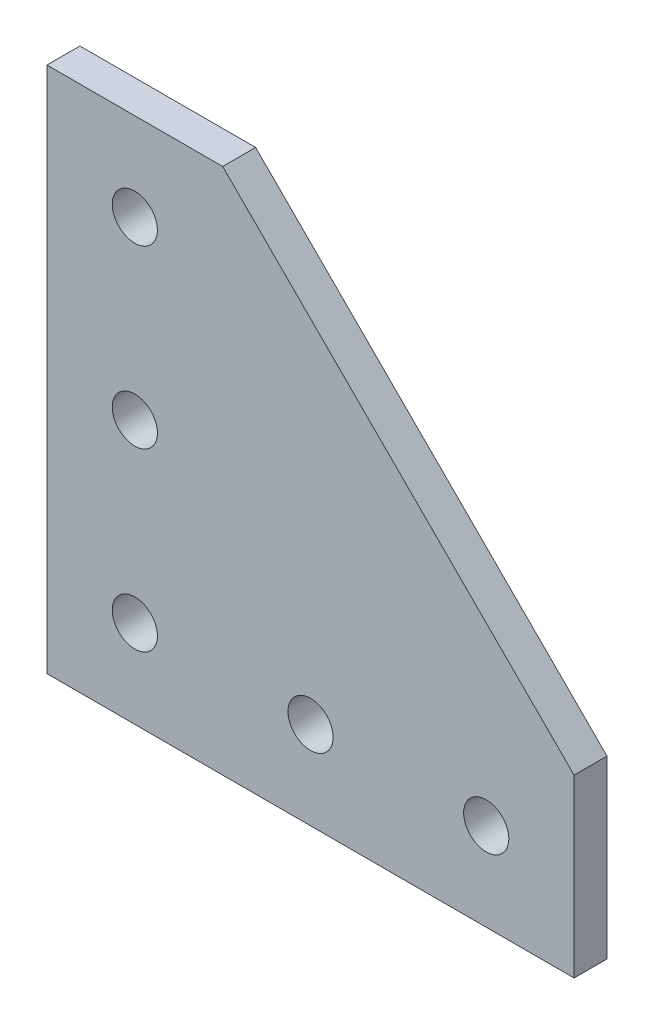
ISO-10303-21;
HEADER;
FILE_DESCRIPTION(('STEP AP214'),'2;1');
FILE_NAME('part.step','',(''),(''),'','','');
FILE_SCHEMA(('AUTOMOTIVE_DESIGN { 1 0 10303 214 1 1 1 1 }'));
ENDSEC;
DATA;
#1=APPLICATION_CONTEXT('core data for automotive mechanical design processes');
#2=APPLICATION_PROTOCOL_DEFINITION('international standard','automotive_design',2000,#1);
#3=PRODUCT_CONTEXT('',#1,'mechanical');
#4=PRODUCT('Part','Part','',(#3));
#5=PRODUCT_RELATED_PRODUCT_CATEGORY('part','',(#4));
#6=PRODUCT_DEFINITION_FORMATION('','',#4);
#7=PRODUCT_DEFINITION_CONTEXT('part definition',#1,'design');
#8=PRODUCT_DEFINITION('design','',#6,#7);
#9=PRODUCT_DEFINITION_SHAPE('','',#8);
#10=(LENGTH_UNIT() NAMED_UNIT(*) SI_UNIT(.MILLI.,.METRE.));
#11=(NAMED_UNIT(*) PLANE_ANGLE_UNIT() SI_UNIT($,.RADIAN.));
#12=(NAMED_UNIT(*) SI_UNIT($,.STERADIAN.) SOLID_ANGLE_UNIT());
#13=UNCERTAINTY_MEASURE_WITH_UNIT(LENGTH_MEASURE(1.E-05),#10,'distance_accuracy_value','');
#14=(GEOMETRIC_REPRESENTATION_CONTEXT(3) GLOBAL_UNCERTAINTY_ASSIGNED_CONTEXT((#13)) GLOBAL_UNIT_ASSIGNED_CONTEXT((#10,
#11,#12)) REPRESENTATION_CONTEXT('',''));
#15=CARTESIAN_POINT('',(0.,0.,0.));
#16=DIRECTION('',(0.,0.,1.));
#17=DIRECTION('',(1.,0.,0.));
#18=AXIS2_PLACEMENT_3D('',#15,#16,#17);
#19=CARTESIAN_POINT('',(0.,0.,2.38125));
#20=DIRECTION('',(0.,0.,-1.));
#21=DIRECTION('',(-1.,0.,0.));
#22=AXIS2_PLACEMENT_3D('',#19,#20,#21);
#23=PLANE('',#22);
#24=CARTESIAN_POINT('',(12.7,63.5,2.38125));
#25=DIRECTION('',(0.,0.,1.));
#26=DIRECTION('',(1.,0.,0.));
#27=AXIS2_PLACEMENT_3D('',#24,#25,#26);
#28=CIRCLE('',#27,3.2639);
#29=CARTESIAN_POINT('',(15.9639,63.5,2.38125));
#30=VERTEX_POINT('',#29);
#31=EDGE_CURVE('E181',#30,#30,#28,.T.);
#32=ORIENTED_EDGE('',*,*,#31,.F.);
#33=EDGE_LOOP('',(#32));
#34=FACE_BOUND('',#33,.T.);
#35=CARTESIAN_POINT('',(38.1,12.7,2.38125));
#36=DIRECTION('',(0.,0.,1.));
#37=DIRECTION('',(1.,0.,0.));
#38=AXIS2_PLACEMENT_3D('',#35,#36,#37);
#39=CIRCLE('',#38,3.26389999999999);
#40=CARTESIAN_POINT('',(41.3639,12.7,2.38125));
#41=VERTEX_POINT('',#40);
#42=EDGE_CURVE('E193',#41,#41,#39,.T.);
#43=ORIENTED_EDGE('',*,*,#42,.F.);
#44=EDGE_LOOP('',(#43));
#45=FACE_BOUND('',#44,.T.);
#46=DIRECTION('',(1.,0.,0.));
#47=VECTOR('',#46,1.);
#48=CARTESIAN_POINT('',(76.2,0.,2.38125));
#49=LINE('',#48,#47);
#50=CARTESIAN_POINT('',(0.,0.,2.38125));
#51=VERTEX_POINT('',#50);
#52=CARTESIAN_POINT('',(76.2,0.,2.38125));
#53=VERTEX_POINT('',#52);
#54=EDGE_CURVE('E121',#51,#53,#49,.T.);
#55=ORIENTED_EDGE('',*,*,#54,.T.);
#56=DIRECTION('',(0.,1.,0.));
#57=VECTOR('',#56,1.);
#58=CARTESIAN_POINT('',(76.2,25.4,2.38125));
#59=LINE('',#58,#57);
#60=CARTESIAN_POINT('',(76.2,25.4,2.38125));
#61=VERTEX_POINT('',#60);
#62=EDGE_CURVE('E88',#53,#61,#59,.T.);
#63=ORIENTED_EDGE('',*,*,#62,.T.);
#64=DIRECTION('',(-0.707106781186547,0.707106781186547,0.));
#65=VECTOR('',#64,1.);
#66=CARTESIAN_POINT('',(76.2,25.4,2.38125));
#67=LINE('',#66,#65);
#68=CARTESIAN_POINT('',(25.4,76.2,2.38125));
#69=VERTEX_POINT('',#68);
#70=EDGE_CURVE('E92',#61,#69,#67,.T.);
#71=ORIENTED_EDGE('',*,*,#70,.T.);
#72=DIRECTION('',(-1.,0.,0.));
#73=VECTOR('',#72,1.);
#74=CARTESIAN_POINT('',(0.,76.2,2.38125));
#75=LINE('',#74,#73);
#76=CARTESIAN_POINT('',(0.,76.2,2.38125));
#77=VERTEX_POINT('',#76);
#78=EDGE_CURVE('E96',#69,#77,#75,.T.);
#79=ORIENTED_EDGE('',*,*,#78,.T.);
#80=DIRECTION('',(0.,-1.,0.));
#81=VECTOR('',#80,1.);
#82=CARTESIAN_POINT('',(0.,0.,2.38125));
#83=LINE('',#82,#81);
#84=EDGE_CURVE('E54',#77,#51,#83,.T.);
#85=ORIENTED_EDGE('',*,*,#84,.T.);
#86=EDGE_LOOP('',(#55,#63,#71,#79,#85));
#87=FACE_BOUND('',#86,.T.);
#88=CARTESIAN_POINT('',(12.7,12.7,2.38125));
#89=DIRECTION('',(0.,0.,1.));
#90=DIRECTION('',(1.,0.,0.));
#91=AXIS2_PLACEMENT_3D('',#88,#89,#90);
#92=CIRCLE('',#91,3.2639);
#93=CARTESIAN_POINT('',(15.9639,12.7,2.38125));
#94=VERTEX_POINT('',#93);
#95=EDGE_CURVE('E116',#94,#94,#92,.T.);
#96=ORIENTED_EDGE('',*,*,#95,.F.);
#97=EDGE_LOOP('',(#96));
#98=FACE_BOUND('',#97,.T.);
#99=CARTESIAN_POINT('',(63.5,12.7,2.38125));
#100=DIRECTION('',(0.,0.,1.));
#101=DIRECTION('',(1.,0.,0.));
#102=AXIS2_PLACEMENT_3D('',#99,#100,#101);
#103=CIRCLE('',#102,3.26389999999999);
#104=CARTESIAN_POINT('',(66.7639,12.7,2.38125));
#105=VERTEX_POINT('',#104);
#106=EDGE_CURVE('E187',#105,#105,#103,.T.);
#107=ORIENTED_EDGE('',*,*,#106,.F.);
#108=EDGE_LOOP('',(#107));
#109=FACE_BOUND('',#108,.T.);
#110=CARTESIAN_POINT('',(12.7,38.1,2.38125));
#111=DIRECTION('',(0.,0.,1.));
#112=DIRECTION('',(1.,0.,0.));
#113=AXIS2_PLACEMENT_3D('',#110,#111,#112);
#114=CIRCLE('',#113,3.26389999999999);
#115=CARTESIAN_POINT('',(15.9639,38.1,2.38125));
#116=VERTEX_POINT('',#115);
#117=EDGE_CURVE('E172',#116,#116,#114,.T.);
#118=ORIENTED_EDGE('',*,*,#117,.F.);
#119=EDGE_LOOP('',(#118));
#120=FACE_BOUND('',#119,.T.);
#121=ADVANCED_FACE('F37',(#34,#45,#87,#98,#109,#120),#23,.F.);
#122=CARTESIAN_POINT('',(0.,0.,-2.38125));
#123=DIRECTION('',(0.,0.,-1.));
#124=DIRECTION('',(-1.,0.,0.));
#125=AXIS2_PLACEMENT_3D('',#122,#123,#124);
#126=PLANE('',#125);
#127=CARTESIAN_POINT('',(12.7,63.5,-2.38125));
#128=DIRECTION('',(0.,0.,1.));
#129=DIRECTION('',(1.,0.,0.));
#130=AXIS2_PLACEMENT_3D('',#127,#128,#129);
#131=CIRCLE('',#130,3.2639);
#132=CARTESIAN_POINT('',(15.9639,63.5,-2.38125));
#133=VERTEX_POINT('',#132);
#134=EDGE_CURVE('E178',#133,#133,#131,.T.);
#135=ORIENTED_EDGE('',*,*,#134,.T.);
#136=EDGE_LOOP('',(#135));
#137=FACE_BOUND('',#136,.T.);
#138=CARTESIAN_POINT('',(38.1,12.7,-2.38125));
#139=DIRECTION('',(0.,0.,1.));
#140=DIRECTION('',(1.,0.,0.));
#141=AXIS2_PLACEMENT_3D('',#138,#139,#140);
#142=CIRCLE('',#141,3.26389999999999);
#143=CARTESIAN_POINT('',(41.3639,12.7,-2.38125));
#144=VERTEX_POINT('',#143);
#145=EDGE_CURVE('E190',#144,#144,#142,.T.);
#146=ORIENTED_EDGE('',*,*,#145,.T.);
#147=EDGE_LOOP('',(#146));
#148=FACE_BOUND('',#147,.T.);
#149=DIRECTION('',(1.,0.,0.));
#150=VECTOR('',#149,1.);
#151=CARTESIAN_POINT('',(76.2,0.,-2.38125));
#152=LINE('',#151,#150);
#153=CARTESIAN_POINT('',(0.,0.,-2.38125));
#154=VERTEX_POINT('',#153);
#155=CARTESIAN_POINT('',(76.2,0.,-2.38125));
#156=VERTEX_POINT('',#155);
#157=EDGE_CURVE('E112',#154,#156,#152,.T.);
#158=ORIENTED_EDGE('',*,*,#157,.F.);
#159=DIRECTION('',(0.,-1.,0.));
#160=VECTOR('',#159,1.);
#161=CARTESIAN_POINT('',(0.,0.,-2.38125));
#162=LINE('',#161,#160);
#163=CARTESIAN_POINT('',(0.,76.2,-2.38125));
#164=VERTEX_POINT('',#163);
#165=EDGE_CURVE('E80',#164,#154,#162,.T.);
#166=ORIENTED_EDGE('',*,*,#165,.F.);
#167=DIRECTION('',(-1.,0.,0.));
#168=VECTOR('',#167,1.);
#169=CARTESIAN_POINT('',(0.,76.2,-2.38125));
#170=LINE('',#169,#168);
#171=CARTESIAN_POINT('',(25.4,76.2,-2.38125));
#172=VERTEX_POINT('',#171);
#173=EDGE_CURVE('E74',#172,#164,#170,.T.);
#174=ORIENTED_EDGE('',*,*,#173,.F.);
#175=DIRECTION('',(-0.707106781186547,0.707106781186547,0.));
#176=VECTOR('',#175,1.);
#177=CARTESIAN_POINT('',(76.2,25.4,-2.38125));
#178=LINE('',#177,#176);
#179=CARTESIAN_POINT('',(76.2,25.4,-2.38125));
#180=VERTEX_POINT('',#179);
#181=EDGE_CURVE('E103',#180,#172,#178,.T.);
#182=ORIENTED_EDGE('',*,*,#181,.F.);
#183=DIRECTION('',(0.,1.,0.));
#184=VECTOR('',#183,1.);
#185=CARTESIAN_POINT('',(76.2,25.4,-2.38125));
#186=LINE('',#185,#184);
#187=EDGE_CURVE('E115',#156,#180,#186,.T.);
#188=ORIENTED_EDGE('',*,*,#187,.F.);
#189=EDGE_LOOP('',(#158,#166,#174,#182,#188));
#190=FACE_BOUND('',#189,.T.);
#191=CARTESIAN_POINT('',(12.7,12.7,-2.38125));
#192=DIRECTION('',(0.,0.,1.));
#193=DIRECTION('',(1.,0.,0.));
#194=AXIS2_PLACEMENT_3D('',#191,#192,#193);
#195=CIRCLE('',#194,3.2639);
#196=CARTESIAN_POINT('',(15.9639,12.7,-2.38125));
#197=VERTEX_POINT('',#196);
#198=EDGE_CURVE('E196',#197,#197,#195,.T.);
#199=ORIENTED_EDGE('',*,*,#198,.T.);
#200=EDGE_LOOP('',(#199));
#201=FACE_BOUND('',#200,.T.);
#202=CARTESIAN_POINT('',(63.5,12.7,-2.38125));
#203=DIRECTION('',(0.,0.,1.));
#204=DIRECTION('',(1.,0.,0.));
#205=AXIS2_PLACEMENT_3D('',#202,#203,#204);
#206=CIRCLE('',#205,3.26389999999999);
#207=CARTESIAN_POINT('',(66.7639,12.7,-2.38125));
#208=VERTEX_POINT('',#207);
#209=EDGE_CURVE('E184',#208,#208,#206,.T.);
#210=ORIENTED_EDGE('',*,*,#209,.T.);
#211=EDGE_LOOP('',(#210));
#212=FACE_BOUND('',#211,.T.);
#213=CARTESIAN_POINT('',(12.7,38.1,-2.38125));
#214=DIRECTION('',(0.,0.,1.));
#215=DIRECTION('',(1.,0.,0.));
#216=AXIS2_PLACEMENT_3D('',#213,#214,#215);
#217=CIRCLE('',#216,3.26389999999999);
#218=CARTESIAN_POINT('',(15.9639,38.1,-2.38125));
#219=VERTEX_POINT('',#218);
#220=EDGE_CURVE('E175',#219,#219,#217,.T.);
#221=ORIENTED_EDGE('',*,*,#220,.T.);
#222=EDGE_LOOP('',(#221));
#223=FACE_BOUND('',#222,.T.);
#224=ADVANCED_FACE('F125',(#137,#148,#190,#201,#212,#223),#126,.T.);
#225=CARTESIAN_POINT('',(76.2,0.,2.38125));
#226=DIRECTION('',(0.,1.,0.));
#227=DIRECTION('',(-1.,0.,0.));
#228=AXIS2_PLACEMENT_3D('',#225,#226,#227);
#229=PLANE('',#228);
#230=ORIENTED_EDGE('',*,*,#157,.T.);
#231=DIRECTION('',(0.,0.,-1.));
#232=VECTOR('',#231,1.);
#233=CARTESIAN_POINT('',(76.2,0.,2.38125));
#234=LINE('',#233,#232);
#235=EDGE_CURVE('E11',#53,#156,#234,.T.);
#236=ORIENTED_EDGE('',*,*,#235,.F.);
#237=ORIENTED_EDGE('',*,*,#54,.F.);
#238=DIRECTION('',(0.,0.,-1.));
#239=VECTOR('',#238,1.);
#240=CARTESIAN_POINT('',(0.,0.,2.38125));
#241=LINE('',#240,#239);
#242=EDGE_CURVE('E108',#51,#154,#241,.T.);
#243=ORIENTED_EDGE('',*,*,#242,.T.);
#244=EDGE_LOOP('',(#230,#236,#237,#243));
#245=FACE_BOUND('',#244,.T.);
#246=ADVANCED_FACE('F39',(#245),#229,.F.);
#247=CARTESIAN_POINT('',(76.2,25.4,2.38125));
#248=DIRECTION('',(-1.,0.,0.));
#249=DIRECTION('',(0.,0.,1.));
#250=AXIS2_PLACEMENT_3D('',#247,#248,#249);
#251=PLANE('',#250);
#252=ORIENTED_EDGE('',*,*,#187,.T.);
#253=DIRECTION('',(0.,0.,-1.));
#254=VECTOR('',#253,1.);
#255=CARTESIAN_POINT('',(76.2,25.4,2.38125));
#256=LINE('',#255,#254);
#257=EDGE_CURVE('E46',#61,#180,#256,.T.);
#258=ORIENTED_EDGE('',*,*,#257,.F.);
#259=ORIENTED_EDGE('',*,*,#62,.F.);
#260=ORIENTED_EDGE('',*,*,#235,.T.);
#261=EDGE_LOOP('',(#252,#258,#259,#260));
#262=FACE_BOUND('',#261,.T.);
#263=ADVANCED_FACE('F253',(#262),#251,.F.);
#264=CARTESIAN_POINT('',(76.2,25.4,2.38125));
#265=DIRECTION('',(-0.707106781186547,-0.707106781186547,0.));
#266=DIRECTION('',(0.707106781186548,-0.707106781186548,0.));
#267=AXIS2_PLACEMENT_3D('',#264,#265,#266);
#268=PLANE('',#267);
#269=ORIENTED_EDGE('',*,*,#181,.T.);
#270=DIRECTION('',(0.,0.,-1.));
#271=VECTOR('',#270,1.);
#272=CARTESIAN_POINT('',(25.4,76.2,2.38125));
#273=LINE('',#272,#271);
#274=EDGE_CURVE('E100',#69,#172,#273,.T.);
#275=ORIENTED_EDGE('',*,*,#274,.F.);
#276=ORIENTED_EDGE('',*,*,#70,.F.);
#277=ORIENTED_EDGE('',*,*,#257,.T.);
#278=EDGE_LOOP('',(#269,#275,#276,#277));
#279=FACE_BOUND('',#278,.T.);
#280=ADVANCED_FACE('F101',(#279),#268,.F.);
#281=CARTESIAN_POINT('',(0.,76.2,2.38125));
#282=DIRECTION('',(0.,-1.,0.));
#283=DIRECTION('',(0.,0.,-1.));
#284=AXIS2_PLACEMENT_3D('',#281,#282,#283);
#285=PLANE('',#284);
#286=ORIENTED_EDGE('',*,*,#173,.T.);
#287=DIRECTION('',(0.,0.,-1.));
#288=VECTOR('',#287,1.);
#289=CARTESIAN_POINT('',(0.,76.2,2.38125));
#290=LINE('',#289,#288);
#291=EDGE_CURVE('E104',#77,#164,#290,.T.);
#292=ORIENTED_EDGE('',*,*,#291,.F.);
#293=ORIENTED_EDGE('',*,*,#78,.F.);
#294=ORIENTED_EDGE('',*,*,#274,.T.);
#295=EDGE_LOOP('',(#286,#292,#293,#294));
#296=FACE_BOUND('',#295,.T.);
#297=ADVANCED_FACE('F106',(#296),#285,.F.);
#298=CARTESIAN_POINT('',(0.,0.,2.38125));
#299=DIRECTION('',(1.,0.,0.));
#300=DIRECTION('',(0.,0.,-1.));
#301=AXIS2_PLACEMENT_3D('',#298,#299,#300);
#302=PLANE('',#301);
#303=ORIENTED_EDGE('',*,*,#165,.T.);
#304=ORIENTED_EDGE('',*,*,#242,.F.);
#305=ORIENTED_EDGE('',*,*,#84,.F.);
#306=ORIENTED_EDGE('',*,*,#291,.T.);
#307=EDGE_LOOP('',(#303,#304,#305,#306));
#308=FACE_BOUND('',#307,.T.);
#309=ADVANCED_FACE('F130',(#308),#302,.F.);
#310=CARTESIAN_POINT('',(12.7,12.7,2.38125));
#311=DIRECTION('',(0.,0.,-1.));
#312=DIRECTION('',(-1.,0.,0.));
#313=AXIS2_PLACEMENT_3D('',#310,#311,#312);
#314=CYLINDRICAL_SURFACE('',#313,3.2639);
#315=ORIENTED_EDGE('',*,*,#95,.T.);
#316=EDGE_LOOP('',(#315));
#317=FACE_BOUND('',#316,.T.);
#318=ORIENTED_EDGE('',*,*,#198,.F.);
#319=EDGE_LOOP('',(#318));
#320=FACE_BOUND('',#319,.T.);
#321=ADVANCED_FACE('F132',(#317,#320),#314,.F.);
#322=CARTESIAN_POINT('',(38.1,12.7,2.38125));
#323=DIRECTION('',(0.,0.,-1.));
#324=DIRECTION('',(-1.,0.,0.));
#325=AXIS2_PLACEMENT_3D('',#322,#323,#324);
#326=CYLINDRICAL_SURFACE('',#325,3.26389999999999);
#327=ORIENTED_EDGE('',*,*,#42,.T.);
#328=EDGE_LOOP('',(#327));
#329=FACE_BOUND('',#328,.T.);
#330=ORIENTED_EDGE('',*,*,#145,.F.);
#331=EDGE_LOOP('',(#330));
#332=FACE_BOUND('',#331,.T.);
#333=ADVANCED_FACE('F138',(#329,#332),#326,.F.);
#334=CARTESIAN_POINT('',(63.5,12.7,2.38125));
#335=DIRECTION('',(0.,0.,-1.));
#336=DIRECTION('',(-1.,0.,0.));
#337=AXIS2_PLACEMENT_3D('',#334,#335,#336);
#338=CYLINDRICAL_SURFACE('',#337,3.26389999999999);
#339=ORIENTED_EDGE('',*,*,#106,.T.);
#340=EDGE_LOOP('',(#339));
#341=FACE_BOUND('',#340,.T.);
#342=ORIENTED_EDGE('',*,*,#209,.F.);
#343=EDGE_LOOP('',(#342));
#344=FACE_BOUND('',#343,.T.);
#345=ADVANCED_FACE('F155',(#341,#344),#338,.F.);
#346=CARTESIAN_POINT('',(12.7,63.5,2.38125));
#347=DIRECTION('',(0.,0.,-1.));
#348=DIRECTION('',(-1.,0.,0.));
#349=AXIS2_PLACEMENT_3D('',#346,#347,#348);
#350=CYLINDRICAL_SURFACE('',#349,3.2639);
#351=ORIENTED_EDGE('',*,*,#31,.T.);
#352=EDGE_LOOP('',(#351));
#353=FACE_BOUND('',#352,.T.);
#354=ORIENTED_EDGE('',*,*,#134,.F.);
#355=EDGE_LOOP('',(#354));
#356=FACE_BOUND('',#355,.T.);
#357=ADVANCED_FACE('F159',(#353,#356),#350,.F.);
#358=CARTESIAN_POINT('',(12.7,38.1,2.38125));
#359=DIRECTION('',(0.,0.,-1.));
#360=DIRECTION('',(-1.,0.,0.));
#361=AXIS2_PLACEMENT_3D('',#358,#359,#360);
#362=CYLINDRICAL_SURFACE('',#361,3.26389999999999);
#363=ORIENTED_EDGE('',*,*,#117,.T.);
#364=EDGE_LOOP('',(#363));
#365=FACE_BOUND('',#364,.T.);
#366=ORIENTED_EDGE('',*,*,#220,.F.);
#367=EDGE_LOOP('',(#366));
#368=FACE_BOUND('',#367,.T.);
#369=ADVANCED_FACE('F163',(#365,#368),#362,.F.);
#370=CLOSED_SHELL('',(#121,#224,#246,#263,#280,#297,#309,#321,#333,#345,#357,#369));
#371=MANIFOLD_SOLID_BREP('B2',#370);
#372=ADVANCED_BREP_SHAPE_REPRESENTATION('',(#18,#371),#14);
#373=SHAPE_DEFINITION_REPRESENTATION(#9,#372);
ENDSEC;
END-ISO-10303-21;
